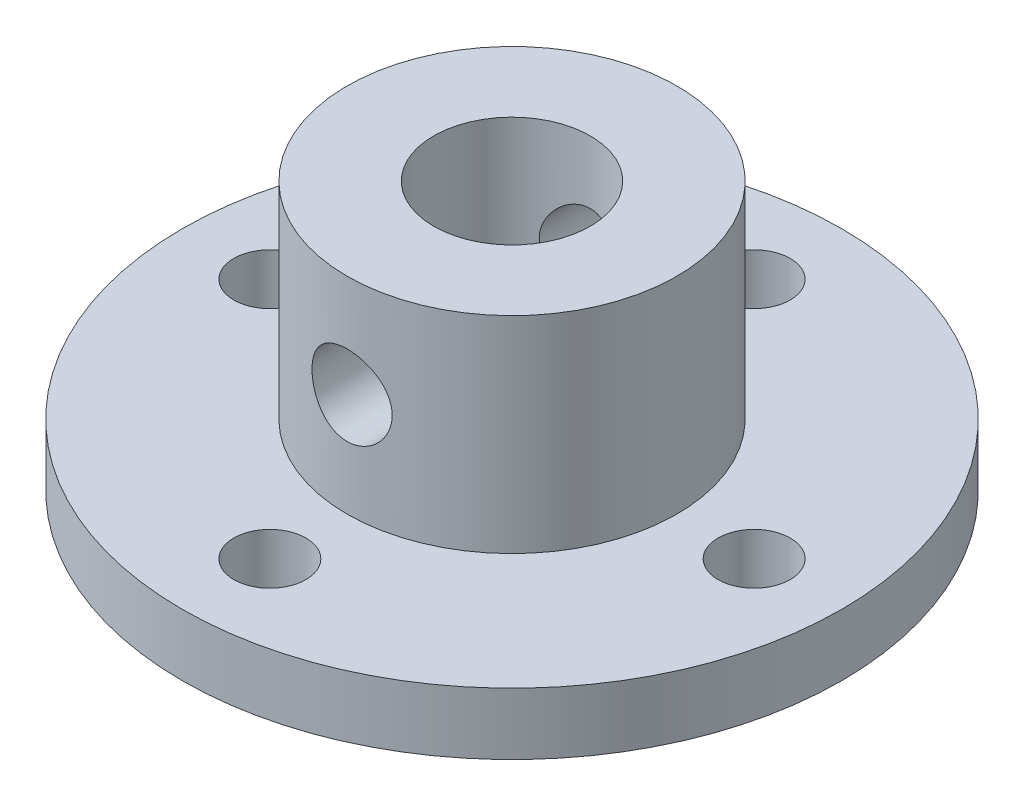
ISO-10303-21;
HEADER;
FILE_DESCRIPTION(('STEP AP214'),'2;1');
FILE_NAME('part.step','',(''),(''),'','','');
FILE_SCHEMA(('AUTOMOTIVE_DESIGN { 1 0 10303 214 1 1 1 1 }'));
ENDSEC;
DATA;
#1=APPLICATION_CONTEXT('core data for automotive mechanical design processes');
#2=APPLICATION_PROTOCOL_DEFINITION('international standard','automotive_design',2000,#1);
#3=PRODUCT_CONTEXT('',#1,'mechanical');
#4=PRODUCT('Part','Part','',(#3));
#5=PRODUCT_RELATED_PRODUCT_CATEGORY('part','',(#4));
#6=PRODUCT_DEFINITION_FORMATION('','',#4);
#7=PRODUCT_DEFINITION_CONTEXT('part definition',#1,'design');
#8=PRODUCT_DEFINITION('design','',#6,#7);
#9=PRODUCT_DEFINITION_SHAPE('','',#8);
#10=(LENGTH_UNIT() NAMED_UNIT(*) SI_UNIT(.MILLI.,.METRE.));
#11=(NAMED_UNIT(*) PLANE_ANGLE_UNIT() SI_UNIT($,.RADIAN.));
#12=(NAMED_UNIT(*) SI_UNIT($,.STERADIAN.) SOLID_ANGLE_UNIT());
#13=UNCERTAINTY_MEASURE_WITH_UNIT(LENGTH_MEASURE(1.E-05),#10,'distance_accuracy_value','');
#14=(GEOMETRIC_REPRESENTATION_CONTEXT(3) GLOBAL_UNCERTAINTY_ASSIGNED_CONTEXT((#13)) GLOBAL_UNIT_ASSIGNED_CONTEXT((#10,
#11,#12)) REPRESENTATION_CONTEXT('',''));
#15=CARTESIAN_POINT('',(0.,0.,0.));
#16=DIRECTION('',(0.,0.,1.));
#17=DIRECTION('',(1.,0.,0.));
#18=AXIS2_PLACEMENT_3D('',#15,#16,#17);
#19=CARTESIAN_POINT('',(0.,3.,-11.75));
#20=DIRECTION('',(0.,-1.,0.));
#21=DIRECTION('',(0.,0.,-1.));
#22=AXIS2_PLACEMENT_3D('',#19,#20,#21);
#23=CYLINDRICAL_SURFACE('',#22,1.75);
#24=CARTESIAN_POINT('',(0.,3.,-11.75));
#25=DIRECTION('',(0.,1.,0.));
#26=DIRECTION('',(0.,0.,1.));
#27=AXIS2_PLACEMENT_3D('',#24,#25,#26);
#28=CIRCLE('',#27,1.75);
#29=CARTESIAN_POINT('',(0.,3.,-10.));
#30=VERTEX_POINT('',#29);
#31=EDGE_CURVE('E53',#30,#30,#28,.T.);
#32=ORIENTED_EDGE('',*,*,#31,.T.);
#33=EDGE_LOOP('',(#32));
#34=FACE_BOUND('',#33,.T.);
#35=CARTESIAN_POINT('',(0.,0.,-11.75));
#36=DIRECTION('',(0.,1.,0.));
#37=DIRECTION('',(0.,0.,1.));
#38=AXIS2_PLACEMENT_3D('',#35,#36,#37);
#39=CIRCLE('',#38,1.75);
#40=CARTESIAN_POINT('',(0.,0.,-10.));
#41=VERTEX_POINT('',#40);
#42=EDGE_CURVE('E67',#41,#41,#39,.T.);
#43=ORIENTED_EDGE('',*,*,#42,.F.);
#44=EDGE_LOOP('',(#43));
#45=FACE_BOUND('',#44,.T.);
#46=ADVANCED_FACE('F35',(#34,#45),#23,.F.);
#47=CARTESIAN_POINT('',(11.75,3.,0.));
#48=DIRECTION('',(0.,-1.,0.));
#49=DIRECTION('',(0.,0.,-1.));
#50=AXIS2_PLACEMENT_3D('',#47,#48,#49);
#51=CYLINDRICAL_SURFACE('',#50,1.75);
#52=CARTESIAN_POINT('',(11.75,3.,0.));
#53=DIRECTION('',(0.,1.,0.));
#54=DIRECTION('',(0.,0.,1.));
#55=AXIS2_PLACEMENT_3D('',#52,#53,#54);
#56=CIRCLE('',#55,1.75);
#57=CARTESIAN_POINT('',(11.75,3.,1.75));
#58=VERTEX_POINT('',#57);
#59=EDGE_CURVE('E160',#58,#58,#56,.T.);
#60=ORIENTED_EDGE('',*,*,#59,.T.);
#61=EDGE_LOOP('',(#60));
#62=FACE_BOUND('',#61,.T.);
#63=CARTESIAN_POINT('',(11.75,0.,0.));
#64=DIRECTION('',(0.,1.,0.));
#65=DIRECTION('',(0.,0.,1.));
#66=AXIS2_PLACEMENT_3D('',#63,#64,#65);
#67=CIRCLE('',#66,1.75);
#68=CARTESIAN_POINT('',(11.75,0.,1.75));
#69=VERTEX_POINT('',#68);
#70=EDGE_CURVE('E64',#69,#69,#67,.T.);
#71=ORIENTED_EDGE('',*,*,#70,.F.);
#72=EDGE_LOOP('',(#71));
#73=FACE_BOUND('',#72,.T.);
#74=ADVANCED_FACE('F123',(#62,#73),#51,.F.);
#75=CARTESIAN_POINT('',(0.,3.,11.75));
#76=DIRECTION('',(0.,-1.,0.));
#77=DIRECTION('',(0.,0.,-1.));
#78=AXIS2_PLACEMENT_3D('',#75,#76,#77);
#79=CYLINDRICAL_SURFACE('',#78,1.75);
#80=CARTESIAN_POINT('',(0.,3.,11.75));
#81=DIRECTION('',(0.,1.,0.));
#82=DIRECTION('',(0.,0.,1.));
#83=AXIS2_PLACEMENT_3D('',#80,#81,#82);
#84=CIRCLE('',#83,1.75);
#85=CARTESIAN_POINT('',(0.,3.,13.5));
#86=VERTEX_POINT('',#85);
#87=EDGE_CURVE('E137',#86,#86,#84,.T.);
#88=ORIENTED_EDGE('',*,*,#87,.T.);
#89=EDGE_LOOP('',(#88));
#90=FACE_BOUND('',#89,.T.);
#91=CARTESIAN_POINT('',(0.,0.,11.75));
#92=DIRECTION('',(0.,1.,0.));
#93=DIRECTION('',(0.,0.,1.));
#94=AXIS2_PLACEMENT_3D('',#91,#92,#93);
#95=CIRCLE('',#94,1.75);
#96=CARTESIAN_POINT('',(0.,0.,13.5));
#97=VERTEX_POINT('',#96);
#98=EDGE_CURVE('E60',#97,#97,#95,.T.);
#99=ORIENTED_EDGE('',*,*,#98,.F.);
#100=EDGE_LOOP('',(#99));
#101=FACE_BOUND('',#100,.T.);
#102=ADVANCED_FACE('F126',(#90,#101),#79,.F.);
#103=CARTESIAN_POINT('',(-11.75,3.,0.));
#104=DIRECTION('',(0.,-1.,0.));
#105=DIRECTION('',(0.,0.,-1.));
#106=AXIS2_PLACEMENT_3D('',#103,#104,#105);
#107=CYLINDRICAL_SURFACE('',#106,1.75);
#108=CARTESIAN_POINT('',(-11.75,3.,0.));
#109=DIRECTION('',(0.,1.,0.));
#110=DIRECTION('',(0.,0.,1.));
#111=AXIS2_PLACEMENT_3D('',#108,#109,#110);
#112=CIRCLE('',#111,1.75);
#113=CARTESIAN_POINT('',(-11.75,3.,1.75));
#114=VERTEX_POINT('',#113);
#115=EDGE_CURVE('E72',#114,#114,#112,.T.);
#116=ORIENTED_EDGE('',*,*,#115,.T.);
#117=EDGE_LOOP('',(#116));
#118=FACE_BOUND('',#117,.T.);
#119=CARTESIAN_POINT('',(-11.75,0.,0.));
#120=DIRECTION('',(0.,1.,0.));
#121=DIRECTION('',(0.,0.,1.));
#122=AXIS2_PLACEMENT_3D('',#119,#120,#121);
#123=CIRCLE('',#122,1.75);
#124=CARTESIAN_POINT('',(-11.75,0.,1.75));
#125=VERTEX_POINT('',#124);
#126=EDGE_CURVE('E57',#125,#125,#123,.T.);
#127=ORIENTED_EDGE('',*,*,#126,.F.);
#128=EDGE_LOOP('',(#127));
#129=FACE_BOUND('',#128,.T.);
#130=ADVANCED_FACE('F37',(#118,#129),#107,.F.);
#131=CARTESIAN_POINT('',(0.,3.,0.));
#132=DIRECTION('',(0.,-1.,0.));
#133=DIRECTION('',(0.,0.,-1.));
#134=AXIS2_PLACEMENT_3D('',#131,#132,#133);
#135=CYLINDRICAL_SURFACE('',#134,16.);
#136=CARTESIAN_POINT('',(0.,3.,0.));
#137=DIRECTION('',(0.,1.,0.));
#138=DIRECTION('',(0.,0.,1.));
#139=AXIS2_PLACEMENT_3D('',#136,#137,#138);
#140=CIRCLE('',#139,16.);
#141=CARTESIAN_POINT('',(0.,3.,16.));
#142=VERTEX_POINT('',#141);
#143=EDGE_CURVE('E10',#142,#142,#140,.T.);
#144=ORIENTED_EDGE('',*,*,#143,.F.);
#145=EDGE_LOOP('',(#144));
#146=FACE_BOUND('',#145,.T.);
#147=CARTESIAN_POINT('',(0.,0.,0.));
#148=DIRECTION('',(0.,1.,0.));
#149=DIRECTION('',(0.,0.,1.));
#150=AXIS2_PLACEMENT_3D('',#147,#148,#149);
#151=CIRCLE('',#150,16.);
#152=CARTESIAN_POINT('',(0.,0.,16.));
#153=VERTEX_POINT('',#152);
#154=EDGE_CURVE('E70',#153,#153,#151,.T.);
#155=ORIENTED_EDGE('',*,*,#154,.T.);
#156=EDGE_LOOP('',(#155));
#157=FACE_BOUND('',#156,.T.);
#158=ADVANCED_FACE('F113',(#146,#157),#135,.T.);
#159=CARTESIAN_POINT('',(0.,3.,0.));
#160=DIRECTION('',(0.,1.,0.));
#161=DIRECTION('',(0.,0.,1.));
#162=AXIS2_PLACEMENT_3D('',#159,#160,#161);
#163=PLANE('',#162);
#164=ORIENTED_EDGE('',*,*,#115,.F.);
#165=EDGE_LOOP('',(#164));
#166=FACE_BOUND('',#165,.T.);
#167=ORIENTED_EDGE('',*,*,#87,.F.);
#168=EDGE_LOOP('',(#167));
#169=FACE_BOUND('',#168,.T.);
#170=ORIENTED_EDGE('',*,*,#59,.F.);
#171=EDGE_LOOP('',(#170));
#172=FACE_BOUND('',#171,.T.);
#173=ORIENTED_EDGE('',*,*,#31,.F.);
#174=EDGE_LOOP('',(#173));
#175=FACE_BOUND('',#174,.T.);
#176=CARTESIAN_POINT('',(0.,3.,0.));
#177=DIRECTION('',(0.,1.,0.));
#178=DIRECTION('',(0.,0.,1.));
#179=AXIS2_PLACEMENT_3D('',#176,#177,#178);
#180=CIRCLE('',#179,8.);
#181=CARTESIAN_POINT('',(0.,3.,8.));
#182=VERTEX_POINT('',#181);
#183=EDGE_CURVE('E48',#182,#182,#180,.T.);
#184=ORIENTED_EDGE('',*,*,#183,.F.);
#185=EDGE_LOOP('',(#184));
#186=FACE_BOUND('',#185,.T.);
#187=ORIENTED_EDGE('',*,*,#143,.T.);
#188=EDGE_LOOP('',(#187));
#189=FACE_BOUND('',#188,.T.);
#190=ADVANCED_FACE('F109',(#166,#169,#172,#175,#186,#189),#163,.T.);
#191=CARTESIAN_POINT('',(0.,0.,0.));
#192=DIRECTION('',(0.,1.,0.));
#193=DIRECTION('',(0.,0.,1.));
#194=AXIS2_PLACEMENT_3D('',#191,#192,#193);
#195=PLANE('',#194);
#196=ORIENTED_EDGE('',*,*,#126,.T.);
#197=EDGE_LOOP('',(#196));
#198=FACE_BOUND('',#197,.T.);
#199=ORIENTED_EDGE('',*,*,#98,.T.);
#200=EDGE_LOOP('',(#199));
#201=FACE_BOUND('',#200,.T.);
#202=ORIENTED_EDGE('',*,*,#70,.T.);
#203=EDGE_LOOP('',(#202));
#204=FACE_BOUND('',#203,.T.);
#205=ORIENTED_EDGE('',*,*,#42,.T.);
#206=EDGE_LOOP('',(#205));
#207=FACE_BOUND('',#206,.T.);
#208=ORIENTED_EDGE('',*,*,#154,.F.);
#209=EDGE_LOOP('',(#208));
#210=FACE_BOUND('',#209,.T.);
#211=CARTESIAN_POINT('',(0.,0.,0.));
#212=DIRECTION('',(0.,1.,0.));
#213=DIRECTION('',(0.,0.,1.));
#214=AXIS2_PLACEMENT_3D('',#211,#212,#213);
#215=CIRCLE('',#214,3.8);
#216=CARTESIAN_POINT('',(0.,0.,3.8));
#217=VERTEX_POINT('',#216);
#218=EDGE_CURVE('E149',#217,#217,#215,.T.);
#219=ORIENTED_EDGE('',*,*,#218,.T.);
#220=EDGE_LOOP('',(#219));
#221=FACE_BOUND('',#220,.T.);
#222=ADVANCED_FACE('F107',(#198,#201,#204,#207,#210,#221),#195,.F.);
#223=CARTESIAN_POINT('',(0.,13.,0.));
#224=DIRECTION('',(0.,-1.,0.));
#225=DIRECTION('',(0.,0.,-1.));
#226=AXIS2_PLACEMENT_3D('',#223,#224,#225);
#227=CYLINDRICAL_SURFACE('',#226,3.8);
#228=CARTESIAN_POINT('',(0.,9.94433441406752,-3.8));
#229=CARTESIAN_POINT('',(-0.101929199490457,9.94432785247445,-3.79999424732507));
#230=CARTESIAN_POINT('',(-0.203971244745734,9.93627218056677,-3.79585534539101));
#231=CARTESIAN_POINT('',(-0.405021233276606,9.90441441578816,-3.77970590830918));
#232=CARTESIAN_POINT('',(-0.504023447738269,9.88058429759448,-3.76768136366227));
#233=CARTESIAN_POINT('',(-0.695782286559949,9.81836306768988,-3.73701492102827));
#234=CARTESIAN_POINT('',(-0.788561873080385,9.78002940329207,-3.71839914876654));
#235=CARTESIAN_POINT('',(-0.966225078551923,9.69019652714189,-3.67624234043326));
#236=CARTESIAN_POINT('',(-1.05110908268025,9.63869795808469,-3.65270154480576));
#237=CARTESIAN_POINT('',(-1.21653665200309,9.52034718029482,-3.60111196219699));
#238=CARTESIAN_POINT('',(-1.29647762593765,9.45273669302948,-3.57287340967342));
#239=CARTESIAN_POINT('',(-1.44444512390473,9.30572080202865,-3.51566258160074));
#240=CARTESIAN_POINT('',(-1.5124621061552,9.22630604536348,-3.48668973948709));
#241=CARTESIAN_POINT('',(-1.64026600612846,9.05012180270978,-3.42853522134101));
#242=CARTESIAN_POINT('',(-1.69891720605315,8.95246243349634,-3.39953205642615));
#243=CARTESIAN_POINT('',(-1.79871657834089,8.74703843455813,-3.34780503998685));
#244=CARTESIAN_POINT('',(-1.83987765978021,8.63928132970324,-3.32507656160825));
#245=CARTESIAN_POINT('',(-1.9007813074054,8.42338833400452,-3.2906224261524));
#246=CARTESIAN_POINT('',(-1.92167685307183,8.31567619203499,-3.27831036517666));
#247=CARTESIAN_POINT('',(-1.94496543144574,8.09763091062087,-3.26455425177237));
#248=CARTESIAN_POINT('',(-1.9473783672839,7.98730071895396,-3.26309850868483));
#249=CARTESIAN_POINT('',(-1.93447710247668,7.78220052799811,-3.27075233207399));
#250=CARTESIAN_POINT('',(-1.92137025301238,7.68723021247538,-3.27854660840881));
#251=CARTESIAN_POINT('',(-1.88164412076872,7.50108824280815,-3.30150519166921));
#252=CARTESIAN_POINT('',(-1.85502017768187,7.409917910528,-3.31667204037019));
#253=CARTESIAN_POINT('',(-1.78855263455357,7.23135932283506,-3.35298892338279));
#254=CARTESIAN_POINT('',(-1.74841740274316,7.14410739266717,-3.3742692807455));
#255=CARTESIAN_POINT('',(-1.65629512700036,6.97714891726937,-3.42042957850981));
#256=CARTESIAN_POINT('',(-1.60430275700108,6.89744578569823,-3.44531113468082));
#257=CARTESIAN_POINT('',(-1.48184928673785,6.73663569920024,-3.49988388777339));
#258=CARTESIAN_POINT('',(-1.40984868791506,6.65676418510514,-3.5297735082578));
#259=CARTESIAN_POINT('',(-1.25338668287402,6.50970045786608,-3.58831453343057));
#260=CARTESIAN_POINT('',(-1.16891881434927,6.44251486177704,-3.61696528594365));
#261=CARTESIAN_POINT('',(-0.984512089062164,6.31950589650581,-3.67157068204172));
#262=CARTESIAN_POINT('',(-0.884005613069019,6.2644322507373,-3.69731469097673));
#263=CARTESIAN_POINT('',(-0.673506178543796,6.17243677790127,-3.74137854645637));
#264=CARTESIAN_POINT('',(-0.56352117144932,6.13549990701508,-3.75970454375762));
#265=CARTESIAN_POINT('',(-0.347248501759365,6.08397875612143,-3.78553181495455));
#266=CARTESIAN_POINT('',(-0.241446749767918,6.06775545599487,-3.79382362377459));
#267=CARTESIAN_POINT('',(-0.028314626320346,6.05294382475011,-3.80138728980309));
#268=CARTESIAN_POINT('',(0.0790149409642813,6.05434653570951,-3.80066372882024));
#269=CARTESIAN_POINT('',(0.282784798712328,6.07384249628091,-3.79072433850799));
#270=CARTESIAN_POINT('',(0.379396348895308,6.09055774795038,-3.78220971086245));
#271=CARTESIAN_POINT('',(0.568235374246256,6.13800494341489,-3.75847952280359));
#272=CARTESIAN_POINT('',(0.660462374811767,6.16873840080332,-3.74326323879572));
#273=CARTESIAN_POINT('',(0.840869731043476,6.24409635266016,-3.70697223117969));
#274=CARTESIAN_POINT('',(0.928869039021883,6.28907963293292,-3.68574789772935));
#275=CARTESIAN_POINT('',(1.09635001315679,6.39124673037719,-3.63944751269311));
#276=CARTESIAN_POINT('',(1.1758281165553,6.44843562111995,-3.61436986059541));
#277=CARTESIAN_POINT('',(1.33258693463822,6.58008374270035,-3.55974457534084));
#278=CARTESIAN_POINT('',(1.40882318830419,6.65570754708443,-3.53000168462397));
#279=CARTESIAN_POINT('',(1.54801852008055,6.81865740773674,-3.47121872000246));
#280=CARTESIAN_POINT('',(1.61096733722663,6.90599242327476,-3.44217920447313));
#281=CARTESIAN_POINT('',(1.72508183589756,7.09586966668527,-3.38649474778862));
#282=CARTESIAN_POINT('',(1.77541403224382,7.19898259614005,-3.3600678575022));
#283=CARTESIAN_POINT('',(1.8574763773163,7.41398725601473,-3.31541768367068));
#284=CARTESIAN_POINT('',(1.88923152340178,7.52586695874163,-3.29718338384549));
#285=CARTESIAN_POINT('',(1.93022362868012,7.74362926261293,-3.27333918489119));
#286=CARTESIAN_POINT('',(1.94134933344102,7.84903776499012,-3.26667447134951));
#287=CARTESIAN_POINT('',(1.94626437278497,8.06038110323712,-3.2637512163216));
#288=CARTESIAN_POINT('',(1.94006249768016,8.16631564502794,-3.26748739843899));
#289=CARTESIAN_POINT('',(1.91228397163311,8.36404924013516,-3.28380526480726));
#290=CARTESIAN_POINT('',(1.89237382624565,8.45617238317024,-3.295426346804));
#291=CARTESIAN_POINT('',(1.83987430689161,8.63564680094704,-3.32502106023988));
#292=CARTESIAN_POINT('',(1.8072806836913,8.72299646527589,-3.34299682044586));
#293=CARTESIAN_POINT('',(1.7279240656258,8.89691444749824,-3.38473196053053));
#294=CARTESIAN_POINT('',(1.68036096299564,8.98304202012917,-3.40879714121822));
#295=CARTESIAN_POINT('',(1.5732675488303,9.14666377460571,-3.45952881973255));
#296=CARTESIAN_POINT('',(1.51373087983557,9.22415333591462,-3.48619669559255));
#297=CARTESIAN_POINT('',(1.37536137103341,9.37873913856103,-3.54325752284911));
#298=CARTESIAN_POINT('',(1.29502852388662,9.45448704346397,-3.57368597373498));
#299=CARTESIAN_POINT('',(1.12201076446249,9.5917674320747,-3.63172318165154));
#300=CARTESIAN_POINT('',(1.02931883702489,9.65329178770151,-3.65933032143472));
#301=CARTESIAN_POINT('',(0.832342354560144,9.76079151021584,-3.70913078739816));
#302=CARTESIAN_POINT('',(0.727927339544904,9.80656283660964,-3.73125210408933));
#303=CARTESIAN_POINT('',(0.511529777532199,9.87928735937688,-3.76699745751057));
#304=CARTESIAN_POINT('',(0.399569288910248,9.90629300303149,-3.78064516523523));
#305=CARTESIAN_POINT('',(0.238656316906829,9.93022668102827,-3.79279753836626));
#306=CARTESIAN_POINT('',(0.191128326502621,9.93550880899672,-3.7954906762817));
#307=CARTESIAN_POINT('',(0.0957418642498799,9.94256426258558,-3.79909328162404));
#308=CARTESIAN_POINT('',(0.0478833837979823,9.94433749651378,-3.80000270243996));
#309=CARTESIAN_POINT('',(0.,9.94433441406752,-3.8));
#310=B_SPLINE_CURVE_WITH_KNOTS('',3,(#228,#229,#230,#231,#232,#233,#234,#235,#236,#237,#238,
#239,#240,#241,#242,#243,#244,#245,#246,#247,#248,#249,#250,#251,#252,#253,#254,#255,#256,#257,
#258,#259,#260,#261,#262,#263,#264,#265,#266,#267,#268,#269,#270,#271,#272,#273,#274,#275,#276,
#277,#278,#279,#280,#281,#282,#283,#284,#285,#286,#287,#288,#289,#290,#291,#292,#293,#294,#295,
#296,#297,#298,#299,#300,#301,#302,#303,#304,#305,#306,#307,#308,#309),.UNSPECIFIED.,.T.,.F.,(4,
2,2,2,2,2,2,2,2,2,2,2,2,2,2,2,2,2,2,2,2,2,2,2,2,2,2,2,2,2,2,2,2,2,2,2,2,2,2,2,4),(0.,
0.305593715826195,0.61173182042358,0.916669821399869,1.22159293850347,1.5455683592126,
1.86980185882241,2.22068111535711,2.57130094379659,2.90054129242694,3.22942704632003,
3.51664186872702,3.80395578190756,4.09791777839494,4.3920120796446,4.72540290276356,
5.05896714713361,5.40946068863938,5.75966301486048,6.07996907671046,6.40011235863624,
6.69400498987409,6.98792936121449,7.28993724207404,7.59207090551578,7.92491433682074,
8.25801386718959,8.60934463026904,8.96020154724154,9.27695527188278,9.59354833597619,
9.87720718415609,10.1609611459878,10.4636419627852,10.7664839166714,11.1085125488565,
11.4507361536338,11.7972388543622,12.1427691939317,12.2863245136307,12.429883584577),.UNSPECIFIED.);
#311=CARTESIAN_POINT('',(0.,9.94433441406752,-3.8));
#312=VERTEX_POINT('',#311);
#313=EDGE_CURVE('E98',#312,#312,#310,.T.);
#314=ORIENTED_EDGE('',*,*,#313,.F.);
#315=EDGE_LOOP('',(#314));
#316=FACE_BOUND('',#315,.T.);
#317=CARTESIAN_POINT('',(1.94433441406752,8.,3.26489872527047));
#318=CARTESIAN_POINT('',(1.94432589668705,7.89906004794262,3.26490933826232));
#319=CARTESIAN_POINT('',(1.93642029236469,7.79799687828778,3.26965223179382));
#320=CARTESIAN_POINT('',(1.90521198266569,7.59900487968823,3.28792821932075));
#321=CARTESIAN_POINT('',(1.88187844554584,7.5010827396077,3.30147891422684));
#322=CARTESIAN_POINT('',(1.82110545141846,7.31162800095056,3.33538106835208));
#323=CARTESIAN_POINT('',(1.78374378970377,7.22006340455484,3.35569495206227));
#324=CARTESIAN_POINT('',(1.6962128403152,7.04452681379158,3.40077615731511));
#325=CARTESIAN_POINT('',(1.64604235426329,6.96055553084123,3.42554389549083));
#326=CARTESIAN_POINT('',(1.52922680682614,6.79456547034758,3.47935965385243));
#327=CARTESIAN_POINT('',(1.46153128223777,6.71334557311194,3.50859259929541));
#328=CARTESIAN_POINT('',(1.31376830819039,6.56278632360079,3.56655490360882));
#329=CARTESIAN_POINT('',(1.23369447336981,6.49345314225027,3.59528399400017));
#330=CARTESIAN_POINT('',(1.0564652982998,6.36378225124482,3.65145371362353));
#331=CARTESIAN_POINT('',(0.958498473794378,6.30444053704484,3.67865581251448));
#332=CARTESIAN_POINT('',(0.75231878304424,6.2034469790215,3.72628202346544));
#333=CARTESIAN_POINT('',(0.644112740801171,6.16178345358463,3.74671060945457));
#334=CARTESIAN_POINT('',(0.42900126692551,6.10053740616691,3.7771511411694));
#335=CARTESIAN_POINT('',(0.322591116922391,6.0795501320072,3.78782154376073));
#336=CARTESIAN_POINT('',(0.107267551339274,6.05561263932324,3.80001224194431));
#337=CARTESIAN_POINT('',(-0.00164422206940478,6.052650909592,3.80153837710392));
#338=CARTESIAN_POINT('',(-0.208261418397452,6.06433748916083,3.79556842170136));
#339=CARTESIAN_POINT('',(-0.306085032378431,6.07740842861212,3.78888039938471));
#340=CARTESIAN_POINT('',(-0.497923782921328,6.11794768789362,3.76847163859138));
#341=CARTESIAN_POINT('',(-0.591938632661454,6.14541708984757,3.75475037152935));
#342=CARTESIAN_POINT('',(-0.77508295325079,6.2141160330666,3.72129495657121));
#343=CARTESIAN_POINT('',(-0.864130962397042,6.25552347081055,3.70148337475236));
#344=CARTESIAN_POINT('',(-1.03422216396182,6.35065852150076,3.6576100079983));
#345=CARTESIAN_POINT('',(-1.11526252720824,6.40439046669339,3.6335467292136));
#346=CARTESIAN_POINT('',(-1.27549581411663,6.52867145528543,3.58062932037507));
#347=CARTESIAN_POINT('',(-1.35373376215591,6.60035097316427,3.55153681053401));
#348=CARTESIAN_POINT('',(-1.49760625201896,6.75548462258722,3.49330954376926));
#349=CARTESIAN_POINT('',(-1.56323030419426,6.8389484547256,3.46417477181054));
#350=CARTESIAN_POINT('',(-1.68445680581293,7.02228408516804,3.4069640467173));
#351=CARTESIAN_POINT('',(-1.7390591156611,7.12288968717338,3.37909885487943));
#352=CARTESIAN_POINT('',(-1.83015823607721,7.33359717092866,3.33064685092919));
#353=CARTESIAN_POINT('',(-1.8666746119483,7.44368863881844,3.31005218055129));
#354=CARTESIAN_POINT('',(-1.91753275812922,7.66098579633954,3.28083382636869));
#355=CARTESIAN_POINT('',(-1.9334188784123,7.7677140686493,3.27138209887074));
#356=CARTESIAN_POINT('',(-1.94723226095523,7.98270223053708,3.26318343455739));
#357=CARTESIAN_POINT('',(-1.94517366736589,8.09096084669759,3.26442806678443));
#358=CARTESIAN_POINT('',(-1.92457358228948,8.29238509493223,3.27660131701378));
#359=CARTESIAN_POINT('',(-1.90799182206614,8.38583280827823,3.28637807625379));
#360=CARTESIAN_POINT('',(-1.86177476381989,8.56842352292893,3.31277792209));
#361=CARTESIAN_POINT('',(-1.8321349688882,8.6575650295224,3.32940336709934));
#362=CARTESIAN_POINT('',(-1.7592330218035,8.83368951168239,3.36851261217467));
#363=CARTESIAN_POINT('',(-1.71540794640382,8.92038550924121,3.39123032480294));
#364=CARTESIAN_POINT('',(-1.61586241246007,9.08570099463958,3.4397752962739));
#365=CARTESIAN_POINT('',(-1.56013582605115,9.16431629087223,3.46560415398846));
#366=CARTESIAN_POINT('',(-1.42970178686736,9.32220316281241,3.52159466808252));
#367=CARTESIAN_POINT('',(-1.35345464724194,9.40016660755172,3.55187509899716));
#368=CARTESIAN_POINT('',(-1.18853303348875,9.54262864310533,3.61040796145384));
#369=CARTESIAN_POINT('',(-1.09985373726256,9.60712198494669,3.63865959962107));
#370=CARTESIAN_POINT('',(-0.908855468839527,9.7225692432108,3.69108089488122));
#371=CARTESIAN_POINT('',(-0.80619657064088,9.77303644771574,3.71509519318928));
#372=CARTESIAN_POINT('',(-0.592263490054969,9.85546941108375,3.75513301849917));
#373=CARTESIAN_POINT('',(-0.480997323187392,9.88745215393022,3.77116387900251));
#374=CARTESIAN_POINT('',(-0.26434308500089,9.92913415863051,3.79220716514611));
#375=CARTESIAN_POINT('',(-0.159391637794554,9.94065195359814,3.79811686553303));
#376=CARTESIAN_POINT('',(0.0510997086019331,9.94650872255962,3.80111157364425));
#377=CARTESIAN_POINT('',(0.156639365473525,9.94085431403129,3.79819998074189));
#378=CARTESIAN_POINT('',(0.357397170995939,9.91369692317458,3.78439970274967));
#379=CARTESIAN_POINT('',(0.452815955361668,9.89334828535598,3.77409236679629));
#380=CARTESIAN_POINT('',(0.638711361641355,9.83898521695248,3.74711552277116));
#381=CARTESIAN_POINT('',(0.729187303634097,9.80496891163783,3.73044514192612));
#382=CARTESIAN_POINT('',(0.906844552802474,9.72280107054147,3.69137497054222));
#383=CARTESIAN_POINT('',(0.99373554312248,9.67412385039917,3.66876702039344));
#384=CARTESIAN_POINT('',(1.15846276074038,9.56467032746451,3.62013155714412));
#385=CARTESIAN_POINT('',(1.23629485571251,9.50388853703147,3.59410249489937));
#386=CARTESIAN_POINT('',(1.3892025749829,9.36466703166119,3.53799586576554));
#387=CARTESIAN_POINT('',(1.46315911507189,9.28505082249253,3.50777811078481));
#388=CARTESIAN_POINT('',(1.59710660985927,9.11422385719577,3.44885711825661));
#389=CARTESIAN_POINT('',(1.65708418141895,9.02300211828275,3.42015535224254));
#390=CARTESIAN_POINT('',(1.7634457418519,8.82679113950944,3.36659510909966));
#391=CARTESIAN_POINT('',(1.80920871708918,8.72140384720533,3.3419300551386));
#392=CARTESIAN_POINT('',(1.86354876108478,8.55761718543337,3.31173788602991));
#393=CARTESIAN_POINT('',(1.87927035835034,8.50212281153023,3.30281301076637));
#394=CARTESIAN_POINT('',(1.90576970675545,8.38962657639426,3.28759454152408));
#395=CARTESIAN_POINT('',(1.91655085484008,8.33262577955264,3.28129913984111));
#396=CARTESIAN_POINT('',(1.93126524239891,8.22969431475645,3.27265504282723));
#397=CARTESIAN_POINT('',(1.93615964485938,8.18394466020537,3.26975598022573));
#398=CARTESIAN_POINT('',(1.94269628200345,8.09213857743205,3.26587533573207));
#399=CARTESIAN_POINT('',(1.94433830250832,8.04608212920692,3.26489388011994));
#400=CARTESIAN_POINT('',(1.94433441406752,8.,3.26489872527047));
#401=B_SPLINE_CURVE_WITH_KNOTS('',3,(#317,#318,#319,#320,#321,#322,#323,#324,#325,#326,#327,
#328,#329,#330,#331,#332,#333,#334,#335,#336,#337,#338,#339,#340,#341,#342,#343,#344,#345,#346,
#347,#348,#349,#350,#351,#352,#353,#354,#355,#356,#357,#358,#359,#360,#361,#362,#363,#364,#365,
#366,#367,#368,#369,#370,#371,#372,#373,#374,#375,#376,#377,#378,#379,#380,#381,#382,#383,#384,
#385,#386,#387,#388,#389,#390,#391,#392,#393,#394,#395,#396,#397,#398,#399,#400),.UNSPECIFIED.,
.T.,.F.,(4,2,2,2,2,2,2,2,2,2,2,2,2,2,2,2,2,2,2,2,2,2,2,2,2,2,2,2,2,2,2,2,2,2,2,2,2,2,2,2,2,4),
(0.,0.302633034419541,0.605872697131481,0.907454953306899,1.20906543549798,1.53679622034363,
1.86469663303642,2.21601366385153,2.56709818412386,2.89222654885125,3.21714726309934,
3.51251194772246,3.80789883381122,4.10720860030243,4.40662374027483,4.73530743231322,
5.06426328450131,5.41585174503518,5.76705902303034,6.09008179598031,6.41284998312458,
6.6977962240491,6.98284067118446,7.28097133775102,7.57925587787728,7.91728273802706,
8.25544107431214,8.60417884915893,8.9525956835437,9.26812234959546,9.58352743976806,
9.87652755723937,10.1695678778876,10.474708709758,10.7799881942898,11.1168646335036,
11.4540622775852,11.8044039492801,11.979262532607,12.1540007059209,12.2921527063775,
12.4303138042396),.UNSPECIFIED.);
#402=CARTESIAN_POINT('',(1.94433441406752,8.,3.26489872527047));
#403=VERTEX_POINT('',#402);
#404=EDGE_CURVE('E93',#403,#403,#401,.T.);
#405=ORIENTED_EDGE('',*,*,#404,.F.);
#406=EDGE_LOOP('',(#405));
#407=FACE_BOUND('',#406,.T.);
#408=CARTESIAN_POINT('',(0.,13.,0.));
#409=DIRECTION('',(0.,1.,0.));
#410=DIRECTION('',(0.,0.,1.));
#411=AXIS2_PLACEMENT_3D('',#408,#409,#410);
#412=CIRCLE('',#411,3.8);
#413=CARTESIAN_POINT('',(0.,13.,3.8));
#414=VERTEX_POINT('',#413);
#415=EDGE_CURVE('E151',#414,#414,#412,.T.);
#416=ORIENTED_EDGE('',*,*,#415,.T.);
#417=EDGE_LOOP('',(#416));
#418=FACE_BOUND('',#417,.T.);
#419=ORIENTED_EDGE('',*,*,#218,.F.);
#420=EDGE_LOOP('',(#419));
#421=FACE_BOUND('',#420,.T.);
#422=ADVANCED_FACE('F103',(#316,#407,#418,#421),#227,.F.);
#423=CARTESIAN_POINT('',(0.,13.,0.));
#424=DIRECTION('',(0.,-1.,0.));
#425=DIRECTION('',(0.,0.,-1.));
#426=AXIS2_PLACEMENT_3D('',#423,#424,#425);
#427=CYLINDRICAL_SURFACE('',#426,8.);
#428=CARTESIAN_POINT('',(0.,9.94433441406752,-8.));
#429=CARTESIAN_POINT('',(-0.107521923225085,9.94433122836091,-7.99999812396955));
#430=CARTESIAN_POINT('',(-0.215080066130903,9.93538541638689,-7.99781062018126));
#431=CARTESIAN_POINT('',(-0.427120106588554,9.89988826452498,-7.98929602753947));
#432=CARTESIAN_POINT('',(-0.531600115404048,9.87332634111269,-7.98296645021391));
#433=CARTESIAN_POINT('',(-0.73439067540863,9.8034946484232,-7.96686951502755));
#434=CARTESIAN_POINT('',(-0.832708259074431,9.76024434265844,-7.95710616311748));
#435=CARTESIAN_POINT('',(-1.0206915614266,9.65833055932345,-7.935184707188));
#436=CARTESIAN_POINT('',(-1.11035710549209,9.59966677075758,-7.92302655485029));
#437=CARTESIAN_POINT('',(-1.28024422962795,9.46737969009504,-7.89737254948717));
#438=CARTESIAN_POINT('',(-1.3602725930193,9.39351207291427,-7.88385697483908));
#439=CARTESIAN_POINT('',(-1.50693522666667,9.23343759809321,-7.85714424251914));
#440=CARTESIAN_POINT('',(-1.57356806379907,9.14722942188259,-7.84394711904964));
#441=CARTESIAN_POINT('',(-1.69244370516977,8.96343743760076,-7.81916777500013));
#442=CARTESIAN_POINT('',(-1.74447281171854,8.86571172141503,-7.80761064926552));
#443=CARTESIAN_POINT('',(-1.83129065459698,8.66257519186321,-7.78770645711004));
#444=CARTESIAN_POINT('',(-1.86608198173609,8.55716553611396,-7.77935890833739));
#445=CARTESIAN_POINT('',(-1.9167822952751,8.34377150768086,-7.76702130871419));
#446=CARTESIAN_POINT('',(-1.93303748689811,8.23587410766119,-7.76295147877203));
#447=CARTESIAN_POINT('',(-1.94728205977346,8.01881289978992,-7.7593911367028));
#448=CARTESIAN_POINT('',(-1.94527424000272,7.90964928855814,-7.75989992285996));
#449=CARTESIAN_POINT('',(-1.92332655925937,7.69578881848463,-7.76536749127971));
#450=CARTESIAN_POINT('',(-1.90379676912825,7.59104687031731,-7.77022450532479));
#451=CARTESIAN_POINT('',(-1.84801263310643,7.38637234337091,-7.78367938505814));
#452=CARTESIAN_POINT('',(-1.81175715422952,7.28644009090369,-7.79227750416396));
#453=CARTESIAN_POINT('',(-1.72319511225699,7.09310972625348,-7.81234080108491));
#454=CARTESIAN_POINT('',(-1.67073767705796,6.9997836192921,-7.82383273190481));
#455=CARTESIAN_POINT('',(-1.55136643435214,6.82311042291596,-7.84837340175693));
#456=CARTESIAN_POINT('',(-1.48445022569265,6.73976499455896,-7.86142239920814));
#457=CARTESIAN_POINT('',(-1.33592592132837,6.58306640122757,-7.88803732849631));
#458=CARTESIAN_POINT('',(-1.25397113448289,6.51004220802933,-7.90160772514058));
#459=CARTESIAN_POINT('',(-1.07881785494933,6.3787135415624,-7.92741926745823));
#460=CARTESIAN_POINT('',(-0.985619054994671,6.32040947068709,-7.93966037678863));
#461=CARTESIAN_POINT('',(-0.790169840070572,6.22006467269023,-7.9614897015944));
#462=CARTESIAN_POINT('',(-0.687892241291716,6.17807496038387,-7.97106956920026));
#463=CARTESIAN_POINT('',(-0.477446102515779,6.1119746624239,-7.98643608024398));
#464=CARTESIAN_POINT('',(-0.369278629594275,6.08786084966478,-7.99222340832061));
#465=CARTESIAN_POINT('',(-0.152937977821267,6.05869365448247,-7.99925234711463));
#466=CARTESIAN_POINT('',(-0.0448286250960311,6.05319196964369,-8.00060085191524));
#467=CARTESIAN_POINT('',(0.170765519192369,6.06017900844842,-7.99890351225523));
#468=CARTESIAN_POINT('',(0.278250362921542,6.07266620711933,-7.99585804028541));
#469=CARTESIAN_POINT('',(0.488003452507928,6.11490641746243,-7.98578320726189));
#470=CARTESIAN_POINT('',(0.590323437636836,6.14441705560114,-7.97880980284691));
#471=CARTESIAN_POINT('',(0.788556898421154,6.21959143253478,-7.96166349697675));
#472=CARTESIAN_POINT('',(0.884469747248192,6.26525674904445,-7.95149028302925));
#473=CARTESIAN_POINT('',(1.06896644887139,6.37232811811769,-7.92881480794855));
#474=CARTESIAN_POINT('',(1.15739831120949,6.4339881353084,-7.91627595326435));
#475=CARTESIAN_POINT('',(1.3228194286408,6.57097176162072,-7.8903214025561));
#476=CARTESIAN_POINT('',(1.39980681959458,6.64629759227917,-7.87690556419531));
#477=CARTESIAN_POINT('',(1.54198389211727,6.81055107543254,-7.85032784302169));
#478=CARTESIAN_POINT('',(1.60685994631405,6.89975274794885,-7.83717898649123));
#479=CARTESIAN_POINT('',(1.72071905365701,7.08804367038755,-7.81297174777776));
#480=CARTESIAN_POINT('',(1.76970281790511,7.18713247764973,-7.80191327206971));
#481=CARTESIAN_POINT('',(1.85002716879939,7.39184657017974,-7.78325771662212));
#482=CARTESIAN_POINT('',(1.88147210034514,7.49742895645444,-7.77564021796623));
#483=CARTESIAN_POINT('',(1.92610989529787,7.71259344665109,-7.76470467499233));
#484=CARTESIAN_POINT('',(1.9393064912371,7.82217472792727,-7.7613857514484));
#485=CARTESIAN_POINT('',(1.94688615099254,8.03904219869366,-7.75948751357221));
#486=CARTESIAN_POINT('',(1.94176946191256,8.14631008903554,-7.76078217007823));
#487=CARTESIAN_POINT('',(1.91400649766797,8.35840468631587,-7.76767531249128));
#488=CARTESIAN_POINT('',(1.89136053811262,8.46323143717131,-7.77327372091052));
#489=CARTESIAN_POINT('',(1.82944804481193,8.66695838405072,-7.788075308984));
#490=CARTESIAN_POINT('',(1.79027045504548,8.76588710870543,-7.7972591785398));
#491=CARTESIAN_POINT('',(1.69647808705561,8.95583582488106,-7.81820061657295));
#492=CARTESIAN_POINT('',(1.64186128614414,9.04685477810028,-7.82995852222869));
#493=CARTESIAN_POINT('',(1.51715147223112,9.22082916546407,-7.85508659257763));
#494=CARTESIAN_POINT('',(1.44670910925341,9.30352949906643,-7.8684894396702));
#495=CARTESIAN_POINT('',(1.29303504402651,9.45609859731246,-7.89519673993674));
#496=CARTESIAN_POINT('',(1.20980033299313,9.5259643347263,-7.90850116918903));
#497=CARTESIAN_POINT('',(1.03121105264023,9.6520250542197,-7.93377991389412));
#498=CARTESIAN_POINT('',(0.935675833237386,9.7079697397756,-7.94572802753413));
#499=CARTESIAN_POINT('',(0.736277416525009,9.80291584775504,-7.9666750715785));
#500=CARTESIAN_POINT('',(0.632420498181634,9.84192990484778,-7.97567619996719));
#501=CARTESIAN_POINT('',(0.4405633450464,9.89584058250715,-7.9883190618234));
#502=CARTESIAN_POINT('',(0.353508659476647,9.91398758013266,-7.99267003412315));
#503=CARTESIAN_POINT('',(0.177644145168197,9.93823540837479,-7.99851118236049));
#504=CARTESIAN_POINT('',(0.0888344344280704,9.94433704609303,-8.00000154997324));
#505=CARTESIAN_POINT('',(0.,9.94433441406752,-8.));
#506=B_SPLINE_CURVE_WITH_KNOTS('',3,(#428,#429,#430,#431,#432,#433,#434,#435,#436,#437,#438,
#439,#440,#441,#442,#443,#444,#445,#446,#447,#448,#449,#450,#451,#452,#453,#454,#455,#456,#457,
#458,#459,#460,#461,#462,#463,#464,#465,#466,#467,#468,#469,#470,#471,#472,#473,#474,#475,#476,
#477,#478,#479,#480,#481,#482,#483,#484,#485,#486,#487,#488,#489,#490,#491,#492,#493,#494,#495,
#496,#497,#498,#499,#500,#501,#502,#503,#504,#505),.UNSPECIFIED.,.T.,.F.,(4,2,2,2,2,2,2,2,2,2,2,
2,2,2,2,2,2,2,2,2,2,2,2,2,2,2,2,2,2,2,2,2,2,2,2,2,2,2,4),(0.,0.322240314402493,
0.644674402069492,0.966733568863209,1.2887992342979,1.61651351713118,1.94426284191983,
2.27658406433288,2.60885532425835,2.93481342233315,3.26072156512974,3.57919580971586,
3.89769163068845,4.21924756287599,4.54085693660416,4.87111472100431,5.2013815324463,
5.53267292882957,5.86390450317053,6.18709876093576,6.51026562214853,6.82894108634317,
7.14764768194324,7.47176261786796,7.7959302897316,8.12758663686599,8.45922814196052,
8.78887495116809,9.11845432411894,9.43910041895158,9.75974074078174,10.0786775078315,
10.3976560781054,10.7245236228086,11.051468165358,11.3839239235509,11.7161311545111,
11.982383408078,12.2486178207563),.UNSPECIFIED.);
#507=CARTESIAN_POINT('',(0.,9.94433441406752,-8.));
#508=VERTEX_POINT('',#507);
#509=EDGE_CURVE('E39',#508,#508,#506,.T.);
#510=ORIENTED_EDGE('',*,*,#509,.T.);
#511=EDGE_LOOP('',(#510));
#512=FACE_BOUND('',#511,.T.);
#513=CARTESIAN_POINT('',(1.94433441406752,8.,7.76012652514589));
#514=CARTESIAN_POINT('',(1.94433119529618,7.8925309605771,7.76012862712909));
#515=CARTESIAN_POINT('',(1.93539388000681,7.78502562848858,7.76238337922451));
#516=CARTESIAN_POINT('',(1.89993353117786,7.57309516242776,7.77113726596501));
#517=CARTESIAN_POINT('',(1.87339969042173,7.46867196259405,7.77763900893758));
#518=CARTESIAN_POINT('',(1.8036500682894,7.26600185605082,7.79410800599488));
#519=CARTESIAN_POINT('',(1.76045506196952,7.16774743411031,7.80407094273475));
#520=CARTESIAN_POINT('',(1.65867171997433,6.97987104359249,7.82633442789076));
#521=CARTESIAN_POINT('',(1.60008295275015,6.89024931712054,7.8386350418387));
#522=CARTESIAN_POINT('',(1.46787356509668,6.72031727239118,7.86447432935024));
#523=CARTESIAN_POINT('',(1.39399173437884,6.64021301183012,7.87803188971568));
#524=CARTESIAN_POINT('',(1.23385639606489,6.49340260039621,7.90469329335564));
#525=CARTESIAN_POINT('',(1.1476017808486,6.42669765032351,7.91779709587894));
#526=CARTESIAN_POINT('',(0.963764613087947,6.30774280126084,7.94228276068677));
#527=CARTESIAN_POINT('',(0.866048108627648,6.255694350855,7.95363973520388));
#528=CARTESIAN_POINT('',(0.662931353550539,6.16883825866159,7.97313714561059));
#529=CARTESIAN_POINT('',(0.557532174945815,6.13402821675293,7.98127802924783));
#530=CARTESIAN_POINT('',(0.344188941391721,6.0832943186224,7.9932924959663));
#531=CARTESIAN_POINT('',(0.236332557712776,6.06702079904496,7.99724498333869));
#532=CARTESIAN_POINT('',(0.0193530490639929,6.05272532699815,8.00071191348055));
#533=CARTESIAN_POINT('',(-0.0897698963651242,6.05470081846124,8.00022697778258));
#534=CARTESIAN_POINT('',(-0.303763249323212,6.07659371674087,7.9949328035283));
#535=CARTESIAN_POINT('',(-0.408674843394741,6.09613382693502,7.99021450367062));
#536=CARTESIAN_POINT('',(-0.613683155247865,6.15199605567811,7.9770890922602));
#537=CARTESIAN_POINT('',(-0.713779624568473,6.18831903920186,7.96868179058063));
#538=CARTESIAN_POINT('',(-0.907322724991962,6.27702775328905,7.94898223528482));
#539=CARTESIAN_POINT('',(-1.00070430856736,6.32954977689252,7.93766564381043));
#540=CARTESIAN_POINT('',(-1.17746184229225,6.44906271529465,7.91337824059355));
#541=CARTESIAN_POINT('',(-1.26083613425334,6.51605602282183,7.90040715543717));
#542=CARTESIAN_POINT('',(-1.41746139406152,6.66463999146859,7.87383535853468));
#543=CARTESIAN_POINT('',(-1.49039845568528,6.74656052463649,7.86022702934008));
#544=CARTESIAN_POINT('',(-1.6215669871493,6.92161265127825,7.83422011248654));
#545=CARTESIAN_POINT('',(-1.67979784479134,7.01474471123369,7.82182157520267));
#546=CARTESIAN_POINT('',(-1.7800872651945,7.21016642258721,7.79961226383132));
#547=CARTESIAN_POINT('',(-1.82207409347046,7.3124942888799,7.789813026885));
#548=CARTESIAN_POINT('',(-1.88815371500636,7.52305096044244,7.774062121643));
#549=CARTESIAN_POINT('',(-1.91225010050761,7.63127857640793,7.76810968097606));
#550=CARTESIAN_POINT('',(-1.94135201585526,7.84766138220537,7.76088741384748));
#551=CARTESIAN_POINT('',(-1.94682002476589,7.95575066043292,7.75950417662362));
#552=CARTESIAN_POINT('',(-1.93977284679421,8.1712969919749,7.76126886799333));
#553=CARTESIAN_POINT('',(-1.92725921489812,8.27875409915032,7.76441640478225));
#554=CARTESIAN_POINT('',(-1.8850085373858,8.48829376608177,7.77477968107135));
#555=CARTESIAN_POINT('',(-1.85553732200529,8.59043332849355,7.78193258627855));
#556=CARTESIAN_POINT('',(-1.78050116183961,8.78832314008983,7.7994416841807));
#557=CARTESIAN_POINT('',(-1.73493439233243,8.88407266338401,7.80979824005083));
#558=CARTESIAN_POINT('',(-1.62802082932876,9.06843375880672,7.8327889111618));
#559=CARTESIAN_POINT('',(-1.56639557086795,9.15687889163232,7.84546190288013));
#560=CARTESIAN_POINT('',(-1.42946926520758,9.32234258695917,7.87156052134209));
#561=CARTESIAN_POINT('',(-1.35416609942684,9.39935937595339,7.88498626445692));
#562=CARTESIAN_POINT('',(-1.18990589379487,9.54163521497855,7.91145956345226));
#563=CARTESIAN_POINT('',(-1.10066955251342,9.60657539283869,7.92449081541457));
#564=CARTESIAN_POINT('',(-0.912288746910549,9.72054710865536,7.94837908542256));
#565=CARTESIAN_POINT('',(-0.813144791078162,9.76957946250206,7.95923621496503));
#566=CARTESIAN_POINT('',(-0.608437599588756,9.84993009242725,7.97748566238386));
#567=CARTESIAN_POINT('',(-0.502925551898278,9.88137299841382,7.98490229217105));
#568=CARTESIAN_POINT('',(-0.287912239147958,9.92603042714499,7.99554124341334));
#569=CARTESIAN_POINT('',(-0.178411702731431,9.93924826239182,7.99876432706146));
#570=CARTESIAN_POINT('',(0.0384676016568971,9.94690261923521,8.0006238886551));
#571=CARTESIAN_POINT('',(0.145828990255589,9.94181093885253,7.99937558810475));
#572=CARTESIAN_POINT('',(0.358117398062261,9.91406552346356,7.99268613132456));
#573=CARTESIAN_POINT('',(0.463044482450703,9.89141225924313,7.98724508749258));
#574=CARTESIAN_POINT('',(0.667021743459044,9.82943385669941,7.97279722043879));
#575=CARTESIAN_POINT('',(0.766097865865551,9.79018980032979,7.96380775293302));
#576=CARTESIAN_POINT('',(0.956314555840681,9.69621819434378,7.94321256687648));
#577=CARTESIAN_POINT('',(1.04745417082117,9.64148878942187,7.931606534868));
#578=CARTESIAN_POINT('',(1.22146335239043,9.51663792902528,7.90670201182346));
#579=CARTESIAN_POINT('',(1.30409656718705,9.4461935530556,7.89337092701845));
#580=CARTESIAN_POINT('',(1.45652938040213,9.29254514084544,7.86667172471674));
#581=CARTESIAN_POINT('',(1.52632576384954,9.2093379177067,7.85330359879177));
#582=CARTESIAN_POINT('',(1.65228950584236,9.03078568681328,7.82778075703171));
#583=CARTESIAN_POINT('',(1.70819902948164,8.9352549277283,7.81565115569944));
#584=CARTESIAN_POINT('',(1.80308054423064,8.73587075091914,7.79431091111054));
#585=CARTESIAN_POINT('',(1.84206534038018,8.63202369591199,7.78509806250872));
#586=CARTESIAN_POINT('',(1.89591255917515,8.44023860833585,7.77213700654082));
#587=CARTESIAN_POINT('',(1.91403233141701,8.35324959363483,7.76766599933145));
#588=CARTESIAN_POINT('',(1.93824413450682,8.17751521792013,7.76166000126337));
#589=CARTESIAN_POINT('',(1.94433707278952,8.08876998992458,7.76012478889674));
#590=CARTESIAN_POINT('',(1.94433441406752,8.,7.76012652514589));
#591=B_SPLINE_CURVE_WITH_KNOTS('',3,(#513,#514,#515,#516,#517,#518,#519,#520,#521,#522,#523,
#524,#525,#526,#527,#528,#529,#530,#531,#532,#533,#534,#535,#536,#537,#538,#539,#540,#541,#542,
#543,#544,#545,#546,#547,#548,#549,#550,#551,#552,#553,#554,#555,#556,#557,#558,#559,#560,#561,
#562,#563,#564,#565,#566,#567,#568,#569,#570,#571,#572,#573,#574,#575,#576,#577,#578,#579,#580,
#581,#582,#583,#584,#585,#586,#587,#588,#589,#590),.UNSPECIFIED.,.T.,.F.,(4,2,2,2,2,2,2,2,2,2,2,
2,2,2,2,2,2,2,2,2,2,2,2,2,2,2,2,2,2,2,2,2,2,2,2,2,2,2,4),(0.,0.322081288711828,
0.644360572750739,0.9662392942734,1.28812704031076,1.61604919483878,1.94400072352519,
2.27626137267671,2.60847574782574,2.93431386030732,3.2601063346123,3.57906357968725,
3.89803726537719,4.21977147991033,4.54155893178547,4.87158657829608,5.20162796112148,
5.53311062617432,5.86452671445128,6.18765243616045,6.51075021682589,6.82891593013081,
7.14711772485305,7.47125435965068,7.79544124309045,8.12724720941951,8.4590361551906,
8.78844343046966,9.11779082635235,9.43871313514375,9.75962684104045,10.0789899955611,
10.398391429317,10.725085923356,11.0518621266029,11.3843152465975,11.7165163964461,
11.9825773045853,12.248618137437),.UNSPECIFIED.);
#592=CARTESIAN_POINT('',(1.94433441406752,8.,7.76012652514589));
#593=VERTEX_POINT('',#592);
#594=EDGE_CURVE('E73',#593,#593,#591,.T.);
#595=ORIENTED_EDGE('',*,*,#594,.T.);
#596=EDGE_LOOP('',(#595));
#597=FACE_BOUND('',#596,.T.);
#598=ORIENTED_EDGE('',*,*,#183,.T.);
#599=EDGE_LOOP('',(#598));
#600=FACE_BOUND('',#599,.T.);
#601=CARTESIAN_POINT('',(0.,13.,0.));
#602=DIRECTION('',(0.,1.,0.));
#603=DIRECTION('',(0.,0.,1.));
#604=AXIS2_PLACEMENT_3D('',#601,#602,#603);
#605=CIRCLE('',#604,8.);
#606=CARTESIAN_POINT('',(0.,13.,8.));
#607=VERTEX_POINT('',#606);
#608=EDGE_CURVE('E61',#607,#607,#605,.T.);
#609=ORIENTED_EDGE('',*,*,#608,.F.);
#610=EDGE_LOOP('',(#609));
#611=FACE_BOUND('',#610,.T.);
#612=ADVANCED_FACE('F78',(#512,#597,#600,#611),#427,.T.);
#613=CARTESIAN_POINT('',(0.,13.,0.));
#614=DIRECTION('',(0.,1.,0.));
#615=DIRECTION('',(0.,0.,1.));
#616=AXIS2_PLACEMENT_3D('',#613,#614,#615);
#617=PLANE('',#616);
#618=ORIENTED_EDGE('',*,*,#415,.F.);
#619=EDGE_LOOP('',(#618));
#620=FACE_BOUND('',#619,.T.);
#621=ORIENTED_EDGE('',*,*,#608,.T.);
#622=EDGE_LOOP('',(#621));
#623=FACE_BOUND('',#622,.T.);
#624=ADVANCED_FACE('F87',(#620,#623),#617,.T.);
#625=CARTESIAN_POINT('',(0.,8.,-16.));
#626=DIRECTION('',(0.,0.,1.));
#627=DIRECTION('',(1.,0.,0.));
#628=AXIS2_PLACEMENT_3D('',#625,#626,#627);
#629=CYLINDRICAL_SURFACE('',#628,1.94433441406752);
#630=ORIENTED_EDGE('',*,*,#404,.T.);
#631=EDGE_LOOP('',(#630));
#632=FACE_BOUND('',#631,.T.);
#633=ORIENTED_EDGE('',*,*,#594,.F.);
#634=EDGE_LOOP('',(#633));
#635=FACE_BOUND('',#634,.T.);
#636=ADVANCED_FACE('F85',(#632,#635),#629,.F.);
#637=ORIENTED_EDGE('',*,*,#313,.T.);
#638=EDGE_LOOP('',(#637));
#639=FACE_BOUND('',#638,.T.);
#640=ORIENTED_EDGE('',*,*,#509,.F.);
#641=EDGE_LOOP('',(#640));
#642=FACE_BOUND('',#641,.T.);
#643=ADVANCED_FACE('F82',(#639,#642),#629,.F.);
#644=CLOSED_SHELL('',(#46,#74,#102,#130,#158,#190,#222,#422,#612,#624,#636,#643));
#645=MANIFOLD_SOLID_BREP('B2',#644);
#646=ADVANCED_BREP_SHAPE_REPRESENTATION('',(#18,#645),#14);
#647=SHAPE_DEFINITION_REPRESENTATION(#9,#646);
ENDSEC;
END-ISO-10303-21;
